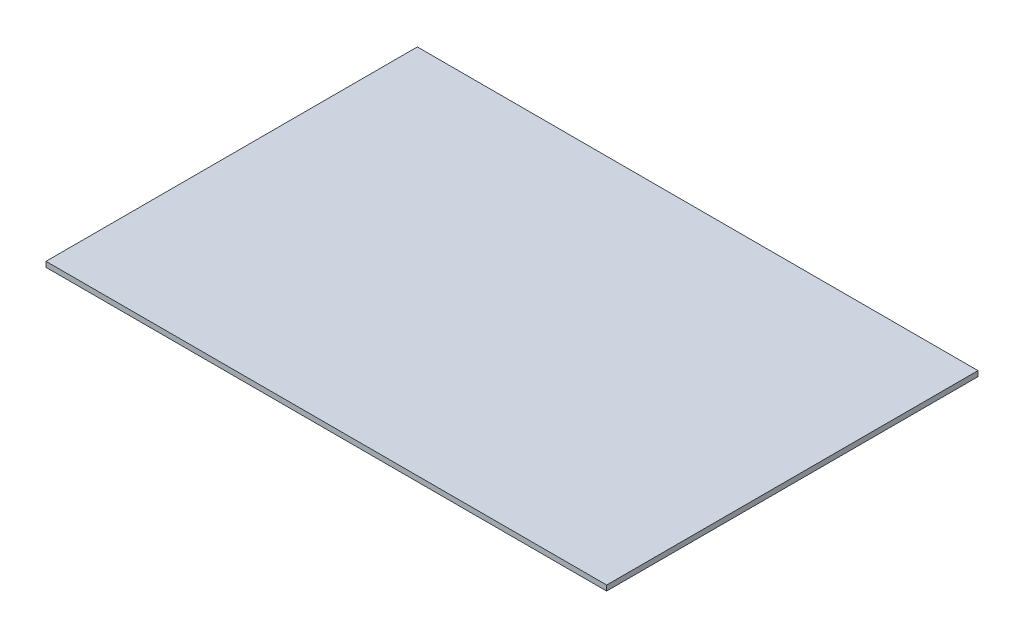
ISO-10303-21;
HEADER;
FILE_DESCRIPTION(('STEP AP214'),'2;1');
FILE_NAME('part.step','',(''),(''),'','','');
FILE_SCHEMA(('AUTOMOTIVE_DESIGN { 1 0 10303 214 1 1 1 1 }'));
ENDSEC;
DATA;
#1=APPLICATION_CONTEXT('core data for automotive mechanical design processes');
#2=APPLICATION_PROTOCOL_DEFINITION('international standard','automotive_design',2000,#1);
#3=PRODUCT_CONTEXT('',#1,'mechanical');
#4=PRODUCT('Part','Part','',(#3));
#5=PRODUCT_RELATED_PRODUCT_CATEGORY('part','',(#4));
#6=PRODUCT_DEFINITION_FORMATION('','',#4);
#7=PRODUCT_DEFINITION_CONTEXT('part definition',#1,'design');
#8=PRODUCT_DEFINITION('design','',#6,#7);
#9=PRODUCT_DEFINITION_SHAPE('','',#8);
#10=(LENGTH_UNIT() NAMED_UNIT(*) SI_UNIT(.MILLI.,.METRE.));
#11=(NAMED_UNIT(*) PLANE_ANGLE_UNIT() SI_UNIT($,.RADIAN.));
#12=(NAMED_UNIT(*) SI_UNIT($,.STERADIAN.) SOLID_ANGLE_UNIT());
#13=UNCERTAINTY_MEASURE_WITH_UNIT(LENGTH_MEASURE(1.E-05),#10,'distance_accuracy_value','');
#14=(GEOMETRIC_REPRESENTATION_CONTEXT(3) GLOBAL_UNCERTAINTY_ASSIGNED_CONTEXT((#13)) GLOBAL_UNIT_ASSIGNED_CONTEXT((#10,
#11,#12)) REPRESENTATION_CONTEXT('',''));
#15=CARTESIAN_POINT('',(0.,0.,0.));
#16=DIRECTION('',(0.,0.,1.));
#17=DIRECTION('',(1.,0.,0.));
#18=AXIS2_PLACEMENT_3D('',#15,#16,#17);
#19=CARTESIAN_POINT('',(84.4,1.5875,-55.9));
#20=DIRECTION('',(-1.,0.,0.));
#21=DIRECTION('',(0.,0.,1.));
#22=AXIS2_PLACEMENT_3D('',#19,#20,#21);
#23=PLANE('',#22);
#24=DIRECTION('',(0.,0.,-1.));
#25=VECTOR('',#24,1.);
#26=CARTESIAN_POINT('',(84.4,0.,-55.9));
#27=LINE('',#26,#25);
#28=CARTESIAN_POINT('',(84.4,0.,55.9));
#29=VERTEX_POINT('',#28);
#30=CARTESIAN_POINT('',(84.4,0.,-55.9));
#31=VERTEX_POINT('',#30);
#32=EDGE_CURVE('E94',#29,#31,#27,.T.);
#33=ORIENTED_EDGE('',*,*,#32,.T.);
#34=DIRECTION('',(0.,-1.,0.));
#35=VECTOR('',#34,1.);
#36=CARTESIAN_POINT('',(84.4,1.5875,-55.9));
#37=LINE('',#36,#35);
#38=CARTESIAN_POINT('',(84.4,1.5875,-55.9));
#39=VERTEX_POINT('',#38);
#40=EDGE_CURVE('E11',#39,#31,#37,.T.);
#41=ORIENTED_EDGE('',*,*,#40,.F.);
#42=DIRECTION('',(0.,0.,-1.));
#43=VECTOR('',#42,1.);
#44=CARTESIAN_POINT('',(84.4,1.5875,-55.9));
#45=LINE('',#44,#43);
#46=CARTESIAN_POINT('',(84.4,1.5875,55.9));
#47=VERTEX_POINT('',#46);
#48=EDGE_CURVE('E82',#47,#39,#45,.T.);
#49=ORIENTED_EDGE('',*,*,#48,.F.);
#50=DIRECTION('',(0.,-1.,0.));
#51=VECTOR('',#50,1.);
#52=CARTESIAN_POINT('',(84.4,1.5875,55.9));
#53=LINE('',#52,#51);
#54=EDGE_CURVE('E90',#47,#29,#53,.T.);
#55=ORIENTED_EDGE('',*,*,#54,.T.);
#56=EDGE_LOOP('',(#33,#41,#49,#55));
#57=FACE_BOUND('',#56,.T.);
#58=ADVANCED_FACE('F31',(#57),#23,.F.);
#59=CARTESIAN_POINT('',(-84.4,1.5875,-55.9));
#60=DIRECTION('',(0.,0.,1.));
#61=DIRECTION('',(1.,0.,0.));
#62=AXIS2_PLACEMENT_3D('',#59,#60,#61);
#63=PLANE('',#62);
#64=DIRECTION('',(-1.,0.,0.));
#65=VECTOR('',#64,1.);
#66=CARTESIAN_POINT('',(-84.4,0.,-55.9));
#67=LINE('',#66,#65);
#68=CARTESIAN_POINT('',(-84.4,0.,-55.9));
#69=VERTEX_POINT('',#68);
#70=EDGE_CURVE('E86',#31,#69,#67,.T.);
#71=ORIENTED_EDGE('',*,*,#70,.T.);
#72=DIRECTION('',(0.,-1.,0.));
#73=VECTOR('',#72,1.);
#74=CARTESIAN_POINT('',(-84.4,1.5875,-55.9));
#75=LINE('',#74,#73);
#76=CARTESIAN_POINT('',(-84.4,1.5875,-55.9));
#77=VERTEX_POINT('',#76);
#78=EDGE_CURVE('E39',#77,#69,#75,.T.);
#79=ORIENTED_EDGE('',*,*,#78,.F.);
#80=DIRECTION('',(-1.,0.,0.));
#81=VECTOR('',#80,1.);
#82=CARTESIAN_POINT('',(-84.4,1.5875,-55.9));
#83=LINE('',#82,#81);
#84=EDGE_CURVE('E77',#39,#77,#83,.T.);
#85=ORIENTED_EDGE('',*,*,#84,.F.);
#86=ORIENTED_EDGE('',*,*,#40,.T.);
#87=EDGE_LOOP('',(#71,#79,#85,#86));
#88=FACE_BOUND('',#87,.T.);
#89=ADVANCED_FACE('F85',(#88),#63,.F.);
#90=CARTESIAN_POINT('',(-84.4,1.5875,-55.9));
#91=DIRECTION('',(1.,0.,0.));
#92=DIRECTION('',(0.,0.,-1.));
#93=AXIS2_PLACEMENT_3D('',#90,#91,#92);
#94=PLANE('',#93);
#95=DIRECTION('',(0.,0.,1.));
#96=VECTOR('',#95,1.);
#97=CARTESIAN_POINT('',(-84.4,0.,-55.9));
#98=LINE('',#97,#96);
#99=CARTESIAN_POINT('',(-84.4,0.,55.9));
#100=VERTEX_POINT('',#99);
#101=EDGE_CURVE('E64',#69,#100,#98,.T.);
#102=ORIENTED_EDGE('',*,*,#101,.T.);
#103=DIRECTION('',(0.,-1.,0.));
#104=VECTOR('',#103,1.);
#105=CARTESIAN_POINT('',(-84.4,1.5875,55.9));
#106=LINE('',#105,#104);
#107=CARTESIAN_POINT('',(-84.4,1.5875,55.9));
#108=VERTEX_POINT('',#107);
#109=EDGE_CURVE('E87',#108,#100,#106,.T.);
#110=ORIENTED_EDGE('',*,*,#109,.F.);
#111=DIRECTION('',(0.,0.,1.));
#112=VECTOR('',#111,1.);
#113=CARTESIAN_POINT('',(-84.4,1.5875,-55.9));
#114=LINE('',#113,#112);
#115=EDGE_CURVE('E80',#77,#108,#114,.T.);
#116=ORIENTED_EDGE('',*,*,#115,.F.);
#117=ORIENTED_EDGE('',*,*,#78,.T.);
#118=EDGE_LOOP('',(#102,#110,#116,#117));
#119=FACE_BOUND('',#118,.T.);
#120=ADVANCED_FACE('F88',(#119),#94,.F.);
#121=CARTESIAN_POINT('',(-84.4,1.5875,55.9));
#122=DIRECTION('',(0.,0.,-1.));
#123=DIRECTION('',(-1.,0.,0.));
#124=AXIS2_PLACEMENT_3D('',#121,#122,#123);
#125=PLANE('',#124);
#126=DIRECTION('',(1.,0.,0.));
#127=VECTOR('',#126,1.);
#128=CARTESIAN_POINT('',(-84.4,0.,55.9));
#129=LINE('',#128,#127);
#130=EDGE_CURVE('E70',#100,#29,#129,.T.);
#131=ORIENTED_EDGE('',*,*,#130,.T.);
#132=ORIENTED_EDGE('',*,*,#54,.F.);
#133=DIRECTION('',(1.,0.,0.));
#134=VECTOR('',#133,1.);
#135=CARTESIAN_POINT('',(-84.4,1.5875,55.9));
#136=LINE('',#135,#134);
#137=EDGE_CURVE('E47',#108,#47,#136,.T.);
#138=ORIENTED_EDGE('',*,*,#137,.F.);
#139=ORIENTED_EDGE('',*,*,#109,.T.);
#140=EDGE_LOOP('',(#131,#132,#138,#139));
#141=FACE_BOUND('',#140,.T.);
#142=ADVANCED_FACE('F101',(#141),#125,.F.);
#143=CARTESIAN_POINT('',(84.4,1.5875,55.9));
#144=DIRECTION('',(0.,1.,0.));
#145=DIRECTION('',(0.,0.,1.));
#146=AXIS2_PLACEMENT_3D('',#143,#144,#145);
#147=PLANE('',#146);
#148=ORIENTED_EDGE('',*,*,#48,.T.);
#149=ORIENTED_EDGE('',*,*,#84,.T.);
#150=ORIENTED_EDGE('',*,*,#115,.T.);
#151=ORIENTED_EDGE('',*,*,#137,.T.);
#152=EDGE_LOOP('',(#148,#149,#150,#151));
#153=FACE_BOUND('',#152,.T.);
#154=ADVANCED_FACE('F78',(#153),#147,.T.);
#155=CARTESIAN_POINT('',(84.4,0.,55.9));
#156=DIRECTION('',(0.,1.,0.));
#157=DIRECTION('',(0.,0.,1.));
#158=AXIS2_PLACEMENT_3D('',#155,#156,#157);
#159=PLANE('',#158);
#160=ORIENTED_EDGE('',*,*,#32,.F.);
#161=ORIENTED_EDGE('',*,*,#130,.F.);
#162=ORIENTED_EDGE('',*,*,#101,.F.);
#163=ORIENTED_EDGE('',*,*,#70,.F.);
#164=EDGE_LOOP('',(#160,#161,#162,#163));
#165=FACE_BOUND('',#164,.T.);
#166=ADVANCED_FACE('F104',(#165),#159,.F.);
#167=CLOSED_SHELL('',(#58,#89,#120,#142,#154,#166));
#168=MANIFOLD_SOLID_BREP('B2',#167);
#169=ADVANCED_BREP_SHAPE_REPRESENTATION('',(#18,#168),#14);
#170=SHAPE_DEFINITION_REPRESENTATION(#9,#169);
ENDSEC;
END-ISO-10303-21;
